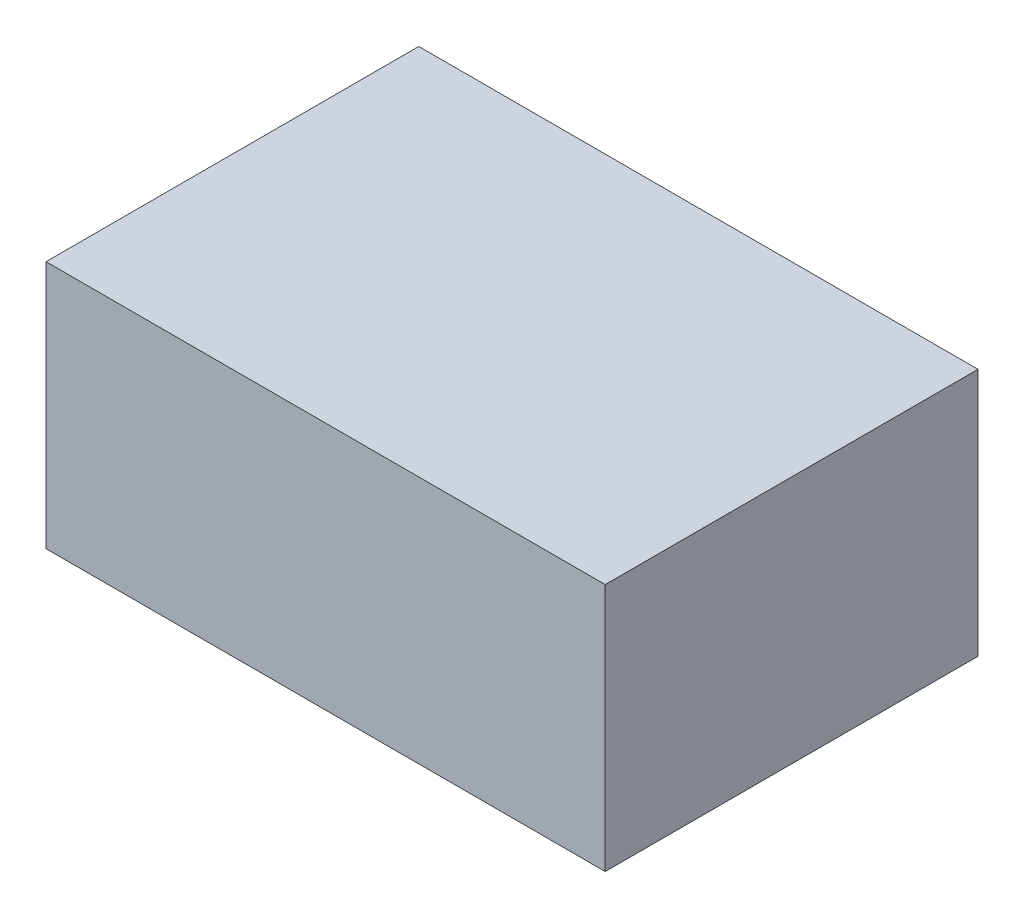
ISO-10303-21;
HEADER;
FILE_DESCRIPTION(('STEP AP214'),'2;1');
FILE_NAME('part.step','',(''),(''),'','','');
FILE_SCHEMA(('AUTOMOTIVE_DESIGN { 1 0 10303 214 1 1 1 1 }'));
ENDSEC;
DATA;
#1=APPLICATION_CONTEXT('core data for automotive mechanical design processes');
#2=APPLICATION_PROTOCOL_DEFINITION('international standard','automotive_design',2000,#1);
#3=PRODUCT_CONTEXT('',#1,'mechanical');
#4=PRODUCT('Part','Part','',(#3));
#5=PRODUCT_RELATED_PRODUCT_CATEGORY('part','',(#4));
#6=PRODUCT_DEFINITION_FORMATION('','',#4);
#7=PRODUCT_DEFINITION_CONTEXT('part definition',#1,'design');
#8=PRODUCT_DEFINITION('design','',#6,#7);
#9=PRODUCT_DEFINITION_SHAPE('','',#8);
#10=(LENGTH_UNIT() NAMED_UNIT(*) SI_UNIT(.MILLI.,.METRE.));
#11=(NAMED_UNIT(*) PLANE_ANGLE_UNIT() SI_UNIT($,.RADIAN.));
#12=(NAMED_UNIT(*) SI_UNIT($,.STERADIAN.) SOLID_ANGLE_UNIT());
#13=UNCERTAINTY_MEASURE_WITH_UNIT(LENGTH_MEASURE(1.E-05),#10,'distance_accuracy_value','');
#14=(GEOMETRIC_REPRESENTATION_CONTEXT(3) GLOBAL_UNCERTAINTY_ASSIGNED_CONTEXT((#13)) GLOBAL_UNIT_ASSIGNED_CONTEXT((#10,
#11,#12)) REPRESENTATION_CONTEXT('',''));
#15=CARTESIAN_POINT('',(0.,0.,0.));
#16=DIRECTION('',(0.,0.,1.));
#17=DIRECTION('',(1.,0.,0.));
#18=AXIS2_PLACEMENT_3D('',#15,#16,#17);
#19=CARTESIAN_POINT('',(-45.,40.,30.));
#20=DIRECTION('',(1.,0.,0.));
#21=DIRECTION('',(0.,0.,-1.));
#22=AXIS2_PLACEMENT_3D('',#19,#20,#21);
#23=PLANE('',#22);
#24=DIRECTION('',(0.,0.,1.));
#25=VECTOR('',#24,1.);
#26=CARTESIAN_POINT('',(-45.,0.,30.));
#27=LINE('',#26,#25);
#28=CARTESIAN_POINT('',(-45.,0.,-30.));
#29=VERTEX_POINT('',#28);
#30=CARTESIAN_POINT('',(-45.,0.,30.));
#31=VERTEX_POINT('',#30);
#32=EDGE_CURVE('E101',#29,#31,#27,.T.);
#33=ORIENTED_EDGE('',*,*,#32,.T.);
#34=DIRECTION('',(0.,-1.,0.));
#35=VECTOR('',#34,1.);
#36=CARTESIAN_POINT('',(-45.,40.,30.));
#37=LINE('',#36,#35);
#38=CARTESIAN_POINT('',(-45.,40.,30.));
#39=VERTEX_POINT('',#38);
#40=EDGE_CURVE('E11',#39,#31,#37,.T.);
#41=ORIENTED_EDGE('',*,*,#40,.F.);
#42=DIRECTION('',(0.,0.,1.));
#43=VECTOR('',#42,1.);
#44=CARTESIAN_POINT('',(-45.,40.,30.));
#45=LINE('',#44,#43);
#46=CARTESIAN_POINT('',(-45.,40.,-30.));
#47=VERTEX_POINT('',#46);
#48=EDGE_CURVE('E89',#47,#39,#45,.T.);
#49=ORIENTED_EDGE('',*,*,#48,.F.);
#50=DIRECTION('',(0.,-1.,0.));
#51=VECTOR('',#50,1.);
#52=CARTESIAN_POINT('',(-45.,40.,-30.));
#53=LINE('',#52,#51);
#54=EDGE_CURVE('E97',#47,#29,#53,.T.);
#55=ORIENTED_EDGE('',*,*,#54,.T.);
#56=EDGE_LOOP('',(#33,#41,#49,#55));
#57=FACE_BOUND('',#56,.T.);
#58=ADVANCED_FACE('F38',(#57),#23,.F.);
#59=CARTESIAN_POINT('',(45.,40.,30.));
#60=DIRECTION('',(0.,0.,-1.));
#61=DIRECTION('',(-1.,0.,0.));
#62=AXIS2_PLACEMENT_3D('',#59,#60,#61);
#63=PLANE('',#62);
#64=DIRECTION('',(1.,0.,0.));
#65=VECTOR('',#64,1.);
#66=CARTESIAN_POINT('',(45.,0.,30.));
#67=LINE('',#66,#65);
#68=CARTESIAN_POINT('',(45.,0.,30.));
#69=VERTEX_POINT('',#68);
#70=EDGE_CURVE('E93',#31,#69,#67,.T.);
#71=ORIENTED_EDGE('',*,*,#70,.T.);
#72=DIRECTION('',(0.,-1.,0.));
#73=VECTOR('',#72,1.);
#74=CARTESIAN_POINT('',(45.,40.,30.));
#75=LINE('',#74,#73);
#76=CARTESIAN_POINT('',(45.,40.,30.));
#77=VERTEX_POINT('',#76);
#78=EDGE_CURVE('E46',#77,#69,#75,.T.);
#79=ORIENTED_EDGE('',*,*,#78,.F.);
#80=DIRECTION('',(1.,0.,0.));
#81=VECTOR('',#80,1.);
#82=CARTESIAN_POINT('',(45.,40.,30.));
#83=LINE('',#82,#81);
#84=EDGE_CURVE('E84',#39,#77,#83,.T.);
#85=ORIENTED_EDGE('',*,*,#84,.F.);
#86=ORIENTED_EDGE('',*,*,#40,.T.);
#87=EDGE_LOOP('',(#71,#79,#85,#86));
#88=FACE_BOUND('',#87,.T.);
#89=ADVANCED_FACE('F92',(#88),#63,.F.);
#90=CARTESIAN_POINT('',(45.,40.,30.));
#91=DIRECTION('',(-1.,0.,0.));
#92=DIRECTION('',(0.,0.,1.));
#93=AXIS2_PLACEMENT_3D('',#90,#91,#92);
#94=PLANE('',#93);
#95=DIRECTION('',(0.,0.,-1.));
#96=VECTOR('',#95,1.);
#97=CARTESIAN_POINT('',(45.,0.,30.));
#98=LINE('',#97,#96);
#99=CARTESIAN_POINT('',(45.,0.,-30.));
#100=VERTEX_POINT('',#99);
#101=EDGE_CURVE('E71',#69,#100,#98,.T.);
#102=ORIENTED_EDGE('',*,*,#101,.T.);
#103=DIRECTION('',(0.,-1.,0.));
#104=VECTOR('',#103,1.);
#105=CARTESIAN_POINT('',(45.,40.,-30.));
#106=LINE('',#105,#104);
#107=CARTESIAN_POINT('',(45.,40.,-30.));
#108=VERTEX_POINT('',#107);
#109=EDGE_CURVE('E94',#108,#100,#106,.T.);
#110=ORIENTED_EDGE('',*,*,#109,.F.);
#111=DIRECTION('',(0.,0.,-1.));
#112=VECTOR('',#111,1.);
#113=CARTESIAN_POINT('',(45.,40.,30.));
#114=LINE('',#113,#112);
#115=EDGE_CURVE('E87',#77,#108,#114,.T.);
#116=ORIENTED_EDGE('',*,*,#115,.F.);
#117=ORIENTED_EDGE('',*,*,#78,.T.);
#118=EDGE_LOOP('',(#102,#110,#116,#117));
#119=FACE_BOUND('',#118,.T.);
#120=ADVANCED_FACE('F95',(#119),#94,.F.);
#121=CARTESIAN_POINT('',(45.,40.,-30.));
#122=DIRECTION('',(0.,0.,1.));
#123=DIRECTION('',(1.,0.,0.));
#124=AXIS2_PLACEMENT_3D('',#121,#122,#123);
#125=PLANE('',#124);
#126=DIRECTION('',(-1.,0.,0.));
#127=VECTOR('',#126,1.);
#128=CARTESIAN_POINT('',(45.,0.,-30.));
#129=LINE('',#128,#127);
#130=EDGE_CURVE('E77',#100,#29,#129,.T.);
#131=ORIENTED_EDGE('',*,*,#130,.T.);
#132=ORIENTED_EDGE('',*,*,#54,.F.);
#133=DIRECTION('',(-1.,0.,0.));
#134=VECTOR('',#133,1.);
#135=CARTESIAN_POINT('',(45.,40.,-30.));
#136=LINE('',#135,#134);
#137=EDGE_CURVE('E54',#108,#47,#136,.T.);
#138=ORIENTED_EDGE('',*,*,#137,.F.);
#139=ORIENTED_EDGE('',*,*,#109,.T.);
#140=EDGE_LOOP('',(#131,#132,#138,#139));
#141=FACE_BOUND('',#140,.T.);
#142=ADVANCED_FACE('F109',(#141),#125,.F.);
#143=CARTESIAN_POINT('',(0.,40.,0.));
#144=DIRECTION('',(0.,1.,0.));
#145=DIRECTION('',(0.,0.,1.));
#146=AXIS2_PLACEMENT_3D('',#143,#144,#145);
#147=PLANE('',#146);
#148=ORIENTED_EDGE('',*,*,#48,.T.);
#149=ORIENTED_EDGE('',*,*,#84,.T.);
#150=ORIENTED_EDGE('',*,*,#115,.T.);
#151=ORIENTED_EDGE('',*,*,#137,.T.);
#152=EDGE_LOOP('',(#148,#149,#150,#151));
#153=FACE_BOUND('',#152,.T.);
#154=ADVANCED_FACE('F85',(#153),#147,.T.);
#155=CARTESIAN_POINT('',(0.,0.,0.));
#156=DIRECTION('',(0.,1.,0.));
#157=DIRECTION('',(0.,0.,1.));
#158=AXIS2_PLACEMENT_3D('',#155,#156,#157);
#159=PLANE('',#158);
#160=CARTESIAN_POINT('',(-40.,0.,-21.5));
#161=DIRECTION('',(0.,-1.,0.));
#162=DIRECTION('',(0.,0.,1.));
#163=AXIS2_PLACEMENT_3D('',#160,#161,#162);
#164=CIRCLE('',#163,1.59999999999999);
#165=CARTESIAN_POINT('',(-40.,0.,-19.9));
#166=VERTEX_POINT('',#165);
#167=EDGE_CURVE('E124',#166,#166,#164,.T.);
#168=ORIENTED_EDGE('',*,*,#167,.F.);
#169=EDGE_LOOP('',(#168));
#170=FACE_BOUND('',#169,.T.);
#171=CARTESIAN_POINT('',(40.,0.,-21.5));
#172=DIRECTION('',(0.,-1.,0.));
#173=DIRECTION('',(0.,0.,-1.));
#174=AXIS2_PLACEMENT_3D('',#171,#172,#173);
#175=CIRCLE('',#174,1.59999999999999);
#176=CARTESIAN_POINT('',(40.,0.,-23.1));
#177=VERTEX_POINT('',#176);
#178=EDGE_CURVE('E130',#177,#177,#175,.T.);
#179=ORIENTED_EDGE('',*,*,#178,.F.);
#180=EDGE_LOOP('',(#179));
#181=FACE_BOUND('',#180,.T.);
#182=CARTESIAN_POINT('',(40.,0.,21.5));
#183=DIRECTION('',(0.,-1.,0.));
#184=DIRECTION('',(0.,0.,1.));
#185=AXIS2_PLACEMENT_3D('',#182,#183,#184);
#186=CIRCLE('',#185,1.6);
#187=CARTESIAN_POINT('',(40.,0.,23.1));
#188=VERTEX_POINT('',#187);
#189=EDGE_CURVE('E118',#188,#188,#186,.T.);
#190=ORIENTED_EDGE('',*,*,#189,.F.);
#191=EDGE_LOOP('',(#190));
#192=FACE_BOUND('',#191,.T.);
#193=CARTESIAN_POINT('',(-40.,0.,21.5));
#194=DIRECTION('',(0.,-1.,0.));
#195=DIRECTION('',(0.,0.,-1.));
#196=AXIS2_PLACEMENT_3D('',#193,#194,#195);
#197=CIRCLE('',#196,1.6);
#198=CARTESIAN_POINT('',(-40.,0.,19.9));
#199=VERTEX_POINT('',#198);
#200=EDGE_CURVE('E115',#199,#199,#197,.T.);
#201=ORIENTED_EDGE('',*,*,#200,.F.);
#202=EDGE_LOOP('',(#201));
#203=FACE_BOUND('',#202,.T.);
#204=ORIENTED_EDGE('',*,*,#32,.F.);
#205=ORIENTED_EDGE('',*,*,#130,.F.);
#206=ORIENTED_EDGE('',*,*,#101,.F.);
#207=ORIENTED_EDGE('',*,*,#70,.F.);
#208=EDGE_LOOP('',(#204,#205,#206,#207));
#209=FACE_BOUND('',#208,.T.);
#210=ADVANCED_FACE('F112',(#170,#181,#192,#203,#209),#159,.F.);
#211=CARTESIAN_POINT('',(-40.,10.,21.5));
#212=DIRECTION('',(0.,-1.,0.));
#213=DIRECTION('',(0.,0.,-1.));
#214=AXIS2_PLACEMENT_3D('',#211,#212,#213);
#215=CYLINDRICAL_SURFACE('',#214,1.6);
#216=CARTESIAN_POINT('',(-40.,10.,21.5));
#217=DIRECTION('',(0.,-1.,0.));
#218=DIRECTION('',(0.,0.,-1.));
#219=AXIS2_PLACEMENT_3D('',#216,#217,#218);
#220=CIRCLE('',#219,1.6);
#221=CARTESIAN_POINT('',(-40.,10.,19.9));
#222=VERTEX_POINT('',#221);
#223=EDGE_CURVE('E104',#222,#222,#220,.T.);
#224=ORIENTED_EDGE('',*,*,#223,.F.);
#225=EDGE_LOOP('',(#224));
#226=FACE_BOUND('',#225,.T.);
#227=ORIENTED_EDGE('',*,*,#200,.T.);
#228=EDGE_LOOP('',(#227));
#229=FACE_BOUND('',#228,.T.);
#230=ADVANCED_FACE('F143',(#226,#229),#215,.F.);
#231=CARTESIAN_POINT('',(-40.,10.,21.5));
#232=DIRECTION('',(0.,-1.,0.));
#233=DIRECTION('',(0.,0.,-1.));
#234=AXIS2_PLACEMENT_3D('',#231,#232,#233);
#235=PLANE('',#234);
#236=ORIENTED_EDGE('',*,*,#223,.T.);
#237=EDGE_LOOP('',(#236));
#238=FACE_BOUND('',#237,.T.);
#239=ADVANCED_FACE('F149',(#238),#235,.T.);
#240=CARTESIAN_POINT('',(40.,10.,21.5));
#241=DIRECTION('',(0.,-1.,0.));
#242=DIRECTION('',(0.,0.,-1.));
#243=AXIS2_PLACEMENT_3D('',#240,#241,#242);
#244=CYLINDRICAL_SURFACE('',#243,1.6);
#245=CARTESIAN_POINT('',(40.,10.,21.5));
#246=DIRECTION('',(0.,-1.,0.));
#247=DIRECTION('',(0.,0.,1.));
#248=AXIS2_PLACEMENT_3D('',#245,#246,#247);
#249=CIRCLE('',#248,1.6);
#250=CARTESIAN_POINT('',(40.,10.,23.1));
#251=VERTEX_POINT('',#250);
#252=EDGE_CURVE('E133',#251,#251,#249,.T.);
#253=ORIENTED_EDGE('',*,*,#252,.F.);
#254=EDGE_LOOP('',(#253));
#255=FACE_BOUND('',#254,.T.);
#256=ORIENTED_EDGE('',*,*,#189,.T.);
#257=EDGE_LOOP('',(#256));
#258=FACE_BOUND('',#257,.T.);
#259=ADVANCED_FACE('F139',(#255,#258),#244,.F.);
#260=CARTESIAN_POINT('',(40.,10.,21.5));
#261=DIRECTION('',(0.,1.,0.));
#262=DIRECTION('',(0.,0.,1.));
#263=AXIS2_PLACEMENT_3D('',#260,#261,#262);
#264=PLANE('',#263);
#265=ORIENTED_EDGE('',*,*,#252,.T.);
#266=EDGE_LOOP('',(#265));
#267=FACE_BOUND('',#266,.T.);
#268=ADVANCED_FACE('F200',(#267),#264,.F.);
#269=CARTESIAN_POINT('',(40.,10.,-21.5));
#270=DIRECTION('',(0.,-1.,0.));
#271=DIRECTION('',(0.,0.,-1.));
#272=AXIS2_PLACEMENT_3D('',#269,#270,#271);
#273=CYLINDRICAL_SURFACE('',#272,1.59999999999999);
#274=CARTESIAN_POINT('',(40.,10.,-21.5));
#275=DIRECTION('',(0.,-1.,0.));
#276=DIRECTION('',(0.,0.,-1.));
#277=AXIS2_PLACEMENT_3D('',#274,#275,#276);
#278=CIRCLE('',#277,1.59999999999999);
#279=CARTESIAN_POINT('',(40.,10.,-23.1));
#280=VERTEX_POINT('',#279);
#281=EDGE_CURVE('E127',#280,#280,#278,.T.);
#282=ORIENTED_EDGE('',*,*,#281,.F.);
#283=EDGE_LOOP('',(#282));
#284=FACE_BOUND('',#283,.T.);
#285=ORIENTED_EDGE('',*,*,#178,.T.);
#286=EDGE_LOOP('',(#285));
#287=FACE_BOUND('',#286,.T.);
#288=ADVANCED_FACE('F211',(#284,#287),#273,.F.);
#289=CARTESIAN_POINT('',(40.,10.,-21.5));
#290=DIRECTION('',(0.,-1.,0.));
#291=DIRECTION('',(0.,0.,-1.));
#292=AXIS2_PLACEMENT_3D('',#289,#290,#291);
#293=PLANE('',#292);
#294=ORIENTED_EDGE('',*,*,#281,.T.);
#295=EDGE_LOOP('',(#294));
#296=FACE_BOUND('',#295,.T.);
#297=ADVANCED_FACE('F222',(#296),#293,.T.);
#298=CARTESIAN_POINT('',(-40.,10.,-21.5));
#299=DIRECTION('',(0.,-1.,0.));
#300=DIRECTION('',(0.,0.,-1.));
#301=AXIS2_PLACEMENT_3D('',#298,#299,#300);
#302=CYLINDRICAL_SURFACE('',#301,1.59999999999999);
#303=CARTESIAN_POINT('',(-40.,10.,-21.5));
#304=DIRECTION('',(0.,-1.,0.));
#305=DIRECTION('',(0.,0.,1.));
#306=AXIS2_PLACEMENT_3D('',#303,#304,#305);
#307=CIRCLE('',#306,1.59999999999999);
#308=CARTESIAN_POINT('',(-40.,10.,-19.9));
#309=VERTEX_POINT('',#308);
#310=EDGE_CURVE('E121',#309,#309,#307,.T.);
#311=ORIENTED_EDGE('',*,*,#310,.F.);
#312=EDGE_LOOP('',(#311));
#313=FACE_BOUND('',#312,.T.);
#314=ORIENTED_EDGE('',*,*,#167,.T.);
#315=EDGE_LOOP('',(#314));
#316=FACE_BOUND('',#315,.T.);
#317=ADVANCED_FACE('F233',(#313,#316),#302,.F.);
#318=CARTESIAN_POINT('',(-40.,10.,-21.5));
#319=DIRECTION('',(0.,1.,0.));
#320=DIRECTION('',(0.,0.,1.));
#321=AXIS2_PLACEMENT_3D('',#318,#319,#320);
#322=PLANE('',#321);
#323=ORIENTED_EDGE('',*,*,#310,.T.);
#324=EDGE_LOOP('',(#323));
#325=FACE_BOUND('',#324,.T.);
#326=ADVANCED_FACE('F244',(#325),#322,.F.);
#327=CLOSED_SHELL('',(#58,#89,#120,#142,#154,#210,#230,#239,#259,#268,#288,#297,#317,#326));
#328=MANIFOLD_SOLID_BREP('B2',#327);
#329=ADVANCED_BREP_SHAPE_REPRESENTATION('',(#18,#328),#14);
#330=SHAPE_DEFINITION_REPRESENTATION(#9,#329);
ENDSEC;
END-ISO-10303-21;
